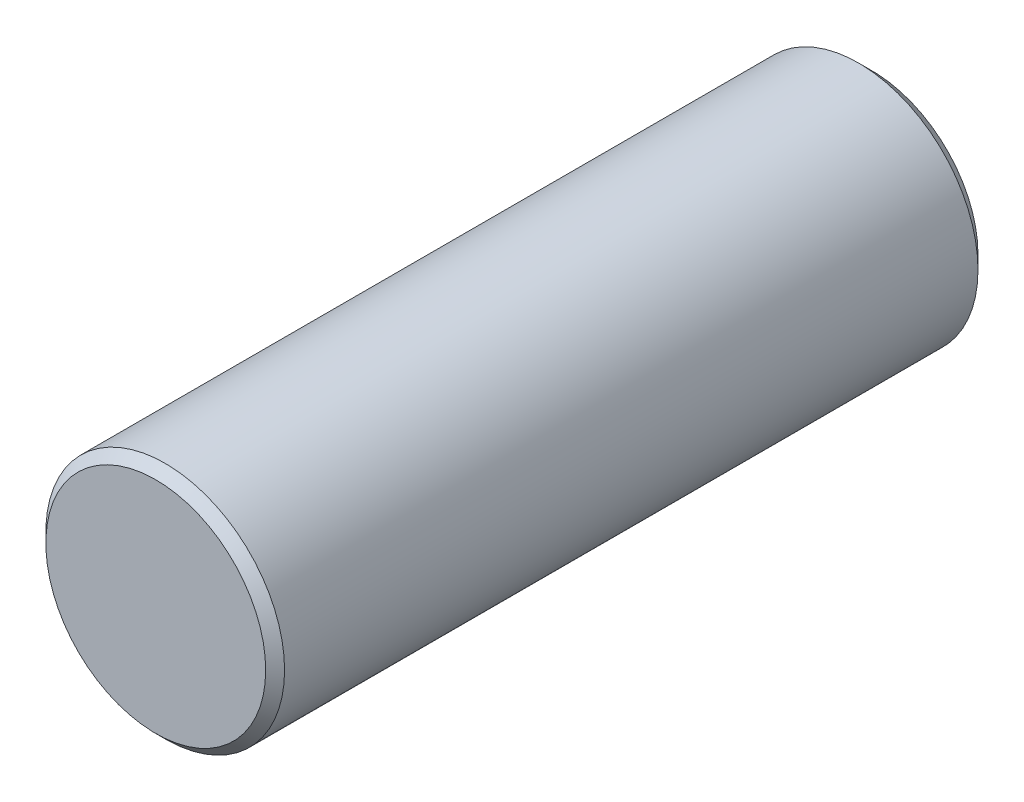
ISO-10303-21;
HEADER;
FILE_DESCRIPTION(('STEP AP214'),'2;1');
FILE_NAME('part.step','',(''),(''),'','','');
FILE_SCHEMA(('AUTOMOTIVE_DESIGN { 1 0 10303 214 1 1 1 1 }'));
ENDSEC;
DATA;
#1=APPLICATION_CONTEXT('core data for automotive mechanical design processes');
#2=APPLICATION_PROTOCOL_DEFINITION('international standard','automotive_design',2000,#1);
#3=PRODUCT_CONTEXT('',#1,'mechanical');
#4=PRODUCT('Part','Part','',(#3));
#5=PRODUCT_RELATED_PRODUCT_CATEGORY('part','',(#4));
#6=PRODUCT_DEFINITION_FORMATION('','',#4);
#7=PRODUCT_DEFINITION_CONTEXT('part definition',#1,'design');
#8=PRODUCT_DEFINITION('design','',#6,#7);
#9=PRODUCT_DEFINITION_SHAPE('','',#8);
#10=(LENGTH_UNIT() NAMED_UNIT(*) SI_UNIT(.MILLI.,.METRE.));
#11=(NAMED_UNIT(*) PLANE_ANGLE_UNIT() SI_UNIT($,.RADIAN.));
#12=(NAMED_UNIT(*) SI_UNIT($,.STERADIAN.) SOLID_ANGLE_UNIT());
#13=UNCERTAINTY_MEASURE_WITH_UNIT(LENGTH_MEASURE(1.E-05),#10,'distance_accuracy_value','');
#14=(GEOMETRIC_REPRESENTATION_CONTEXT(3) GLOBAL_UNCERTAINTY_ASSIGNED_CONTEXT((#13)) GLOBAL_UNIT_ASSIGNED_CONTEXT((#10,
#11,#12)) REPRESENTATION_CONTEXT('',''));
#15=CARTESIAN_POINT('',(0.,0.,0.));
#16=DIRECTION('',(0.,0.,1.));
#17=DIRECTION('',(1.,0.,0.));
#18=AXIS2_PLACEMENT_3D('',#15,#16,#17);
#19=CARTESIAN_POINT('',(0.,0.,9.525));
#20=DIRECTION('',(0.,0.,-1.));
#21=DIRECTION('',(-1.,0.,0.));
#22=AXIS2_PLACEMENT_3D('',#19,#20,#21);
#23=PLANE('',#22);
#24=CARTESIAN_POINT('',(0.,0.,9.525));
#25=DIRECTION('',(0.,0.,1.));
#26=DIRECTION('',(1.,0.,0.));
#27=AXIS2_PLACEMENT_3D('',#24,#25,#26);
#28=CIRCLE('',#27,2.9235528286101);
#29=CARTESIAN_POINT('',(2.9235528286101,0.,9.525));
#30=VERTEX_POINT('',#29);
#31=EDGE_CURVE('E10',#30,#30,#28,.T.);
#32=ORIENTED_EDGE('',*,*,#31,.T.);
#33=EDGE_LOOP('',(#32));
#34=FACE_BOUND('',#33,.T.);
#35=ADVANCED_FACE('F32',(#34),#23,.F.);
#36=CARTESIAN_POINT('',(0.,0.,9.2735528286101));
#37=DIRECTION('',(0.,0.,-1.));
#38=DIRECTION('',(-1.,0.,0.));
#39=AXIS2_PLACEMENT_3D('',#36,#37,#38);
#40=CONICAL_SURFACE('',#39,3.175,0.785398163397447);
#41=ORIENTED_EDGE('',*,*,#31,.F.);
#42=EDGE_LOOP('',(#41));
#43=FACE_BOUND('',#42,.T.);
#44=CARTESIAN_POINT('',(0.,0.,9.2735528286101));
#45=DIRECTION('',(0.,0.,1.));
#46=DIRECTION('',(1.,0.,0.));
#47=AXIS2_PLACEMENT_3D('',#44,#45,#46);
#48=CIRCLE('',#47,3.175);
#49=CARTESIAN_POINT('',(3.175,0.,9.2735528286101));
#50=VERTEX_POINT('',#49);
#51=EDGE_CURVE('E38',#50,#50,#48,.T.);
#52=ORIENTED_EDGE('',*,*,#51,.T.);
#53=EDGE_LOOP('',(#52));
#54=FACE_BOUND('',#53,.T.);
#55=ADVANCED_FACE('F64',(#43,#54),#40,.T.);
#56=CARTESIAN_POINT('',(0.,0.,-9.525));
#57=DIRECTION('',(0.,0.,1.));
#58=DIRECTION('',(1.,0.,0.));
#59=AXIS2_PLACEMENT_3D('',#56,#57,#58);
#60=CYLINDRICAL_SURFACE('',#59,3.175);
#61=ORIENTED_EDGE('',*,*,#51,.F.);
#62=EDGE_LOOP('',(#61));
#63=FACE_BOUND('',#62,.T.);
#64=CARTESIAN_POINT('',(0.,0.,-9.1694));
#65=DIRECTION('',(0.,0.,1.));
#66=DIRECTION('',(1.,0.,0.));
#67=AXIS2_PLACEMENT_3D('',#64,#65,#66);
#68=CIRCLE('',#67,3.175);
#69=CARTESIAN_POINT('',(3.175,0.,-9.1694));
#70=VERTEX_POINT('',#69);
#71=EDGE_CURVE('E42',#70,#70,#68,.T.);
#72=ORIENTED_EDGE('',*,*,#71,.T.);
#73=EDGE_LOOP('',(#72));
#74=FACE_BOUND('',#73,.T.);
#75=ADVANCED_FACE('F60',(#63,#74),#60,.T.);
#76=CARTESIAN_POINT('',(0.,0.,-9.525));
#77=DIRECTION('',(0.,0.,1.));
#78=DIRECTION('',(1.,0.,0.));
#79=AXIS2_PLACEMENT_3D('',#76,#77,#78);
#80=CONICAL_SURFACE('',#79,2.8194,0.785398163397447);
#81=ORIENTED_EDGE('',*,*,#71,.F.);
#82=EDGE_LOOP('',(#81));
#83=FACE_BOUND('',#82,.T.);
#84=CARTESIAN_POINT('',(0.,0.,-9.525));
#85=DIRECTION('',(0.,0.,1.));
#86=DIRECTION('',(1.,0.,0.));
#87=AXIS2_PLACEMENT_3D('',#84,#85,#86);
#88=CIRCLE('',#87,2.8194);
#89=CARTESIAN_POINT('',(2.8194,0.,-9.525));
#90=VERTEX_POINT('',#89);
#91=EDGE_CURVE('E46',#90,#90,#88,.T.);
#92=ORIENTED_EDGE('',*,*,#91,.T.);
#93=EDGE_LOOP('',(#92));
#94=FACE_BOUND('',#93,.T.);
#95=ADVANCED_FACE('F52',(#83,#94),#80,.T.);
#96=CARTESIAN_POINT('',(0.,2.8194,-9.525));
#97=DIRECTION('',(0.,0.,1.));
#98=DIRECTION('',(1.,0.,0.));
#99=AXIS2_PLACEMENT_3D('',#96,#97,#98);
#100=PLANE('',#99);
#101=ORIENTED_EDGE('',*,*,#91,.F.);
#102=EDGE_LOOP('',(#101));
#103=FACE_BOUND('',#102,.T.);
#104=ADVANCED_FACE('F54',(#103),#100,.F.);
#105=CLOSED_SHELL('',(#35,#55,#75,#95,#104));
#106=MANIFOLD_SOLID_BREP('B2',#105);
#107=ADVANCED_BREP_SHAPE_REPRESENTATION('',(#18,#106),#14);
#108=SHAPE_DEFINITION_REPRESENTATION(#9,#107);
ENDSEC;
END-ISO-10303-21;
